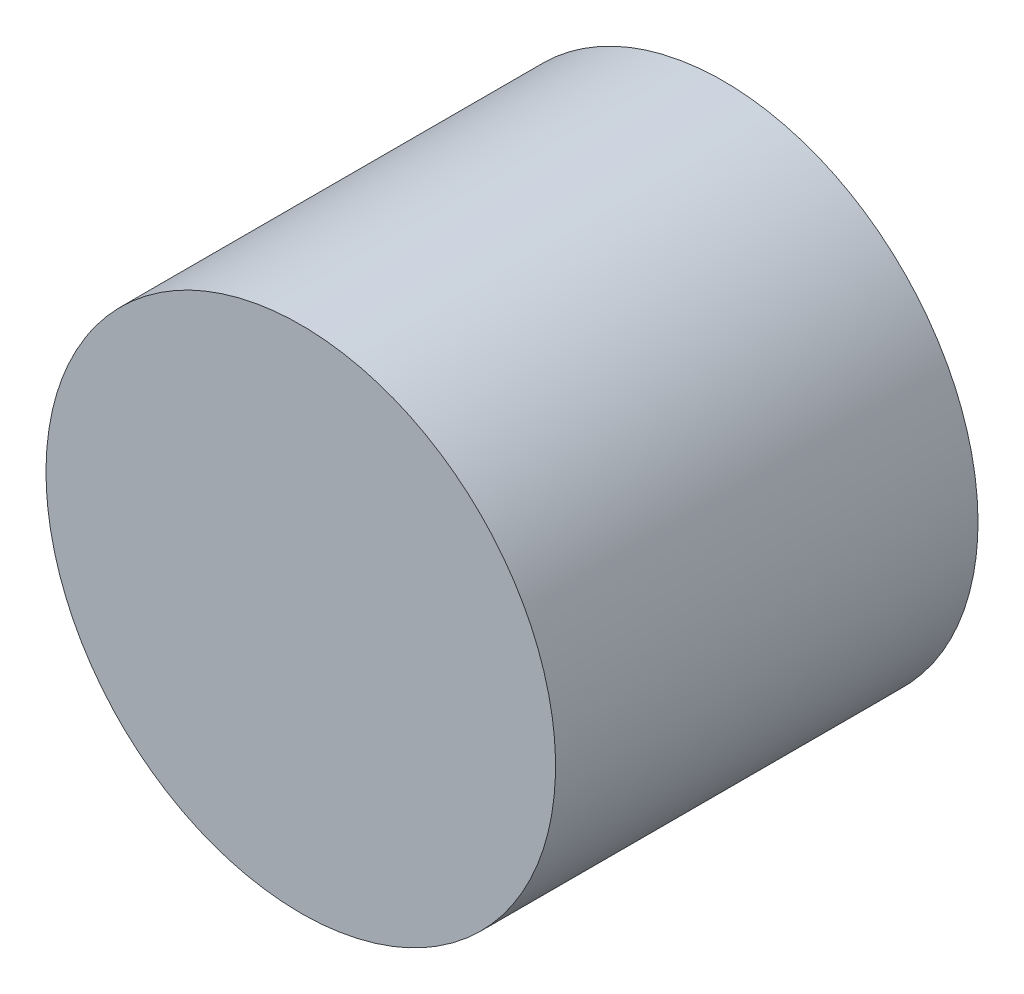
ISO-10303-21;
HEADER;
FILE_DESCRIPTION(('STEP AP214'),'2;1');
FILE_NAME('part.step','',(''),(''),'','','');
FILE_SCHEMA(('AUTOMOTIVE_DESIGN { 1 0 10303 214 1 1 1 1 }'));
ENDSEC;
DATA;
#1=APPLICATION_CONTEXT('core data for automotive mechanical design processes');
#2=APPLICATION_PROTOCOL_DEFINITION('international standard','automotive_design',2000,#1);
#3=PRODUCT_CONTEXT('',#1,'mechanical');
#4=PRODUCT('Part','Part','',(#3));
#5=PRODUCT_RELATED_PRODUCT_CATEGORY('part','',(#4));
#6=PRODUCT_DEFINITION_FORMATION('','',#4);
#7=PRODUCT_DEFINITION_CONTEXT('part definition',#1,'design');
#8=PRODUCT_DEFINITION('design','',#6,#7);
#9=PRODUCT_DEFINITION_SHAPE('','',#8);
#10=(LENGTH_UNIT() NAMED_UNIT(*) SI_UNIT(.MILLI.,.METRE.));
#11=(NAMED_UNIT(*) PLANE_ANGLE_UNIT() SI_UNIT($,.RADIAN.));
#12=(NAMED_UNIT(*) SI_UNIT($,.STERADIAN.) SOLID_ANGLE_UNIT());
#13=UNCERTAINTY_MEASURE_WITH_UNIT(LENGTH_MEASURE(1.E-05),#10,'distance_accuracy_value','');
#14=(GEOMETRIC_REPRESENTATION_CONTEXT(3) GLOBAL_UNCERTAINTY_ASSIGNED_CONTEXT((#13)) GLOBAL_UNIT_ASSIGNED_CONTEXT((#10,
#11,#12)) REPRESENTATION_CONTEXT('',''));
#15=CARTESIAN_POINT('',(0.,0.,0.));
#16=DIRECTION('',(0.,0.,1.));
#17=DIRECTION('',(1.,0.,0.));
#18=AXIS2_PLACEMENT_3D('',#15,#16,#17);
#19=CARTESIAN_POINT('',(-8.60005925706711,59.3566266738353,123.808385168912));
#20=CARTESIAN_POINT('',(-8.53276726538406,59.3566266738353,123.808385168912));
#21=CARTESIAN_POINT('',(-8.39818328201795,59.3833970925781,123.808385168912));
#22=CARTESIAN_POINT('',(-8.22704109415974,59.4977506465517,123.808385168912));
#23=CARTESIAN_POINT('',(-8.11268754018612,59.6688928344099,123.808385168912));
#24=CARTESIAN_POINT('',(-8.07253191207202,59.8707688094591,123.808385168912));
#25=CARTESIAN_POINT('',(-8.11268754018612,60.0726447845082,123.808385168912));
#26=CARTESIAN_POINT('',(-8.22704109415974,60.2437869723664,123.808385168912));
#27=CARTESIAN_POINT('',(-8.39818328201795,60.3581405263401,123.808385168912));
#28=CARTESIAN_POINT('',(-8.60005925706711,60.3982961544542,123.808385168912));
#29=CARTESIAN_POINT('',(-8.80193523211629,60.3581405263401,123.808385168912));
#30=CARTESIAN_POINT('',(-8.97307741997449,60.2437869723664,123.808385168912));
#31=CARTESIAN_POINT('',(-9.08743097394811,60.0726447845082,123.808385168912));
#32=CARTESIAN_POINT('',(-9.12758660206221,59.8707688094591,123.808385168912));
#33=CARTESIAN_POINT('',(-9.08743097394811,59.6688928344099,123.808385168912));
#34=CARTESIAN_POINT('',(-8.97307741997449,59.4977506465517,123.808385168912));
#35=CARTESIAN_POINT('',(-8.80193523211629,59.3833970925781,123.808385168912));
#36=CARTESIAN_POINT('',(-8.66735124875017,59.3566266738353,123.808385168912));
#37=CARTESIAN_POINT('',(-8.60005925706711,59.3566266738353,123.808385168912));
#38=B_SPLINE_CURVE_WITH_KNOTS('',3,(#19,#20,#21,#22,#23,#24,#25,#26,#27,#28,#29,#30,#31,#32,#33,
#34,#35,#36,#37),.UNSPECIFIED.,.T.,.F.,(4,1,1,1,1,1,1,1,1,1,1,1,1,1,1,1,4),(0.,
0.0625000000000002,0.125,0.187500000000001,0.25,0.312499999999999,0.375,0.4375,0.5,0.5625,0.625,
0.687500000000001,0.75,0.812499999999999,0.875,0.9375,1.),.UNSPECIFIED.);
#39=DIRECTION('',(0.,0.,1.));
#40=VECTOR('',#39,1.);
#41=SURFACE_OF_LINEAR_EXTRUSION('',#38,#40);
#42=CARTESIAN_POINT('',(-8.60005925706711,59.3566266738353,123.808385168912));
#43=CARTESIAN_POINT('',(-8.53276726538406,59.3566266738353,123.808385168912));
#44=CARTESIAN_POINT('',(-8.39818328201795,59.3833970925781,123.808385168912));
#45=CARTESIAN_POINT('',(-8.22704109415974,59.4977506465517,123.808385168912));
#46=CARTESIAN_POINT('',(-8.11268754018612,59.6688928344099,123.808385168912));
#47=CARTESIAN_POINT('',(-8.07253191207202,59.8707688094591,123.808385168912));
#48=CARTESIAN_POINT('',(-8.11268754018612,60.0726447845082,123.808385168912));
#49=CARTESIAN_POINT('',(-8.22704109415974,60.2437869723664,123.808385168912));
#50=CARTESIAN_POINT('',(-8.39818328201795,60.3581405263401,123.808385168912));
#51=CARTESIAN_POINT('',(-8.60005925706711,60.3982961544542,123.808385168912));
#52=CARTESIAN_POINT('',(-8.80193523211629,60.3581405263401,123.808385168912));
#53=CARTESIAN_POINT('',(-8.97307741997449,60.2437869723664,123.808385168912));
#54=CARTESIAN_POINT('',(-9.08743097394811,60.0726447845082,123.808385168912));
#55=CARTESIAN_POINT('',(-9.12758660206221,59.8707688094591,123.808385168912));
#56=CARTESIAN_POINT('',(-9.08743097394811,59.6688928344099,123.808385168912));
#57=CARTESIAN_POINT('',(-8.97307741997449,59.4977506465517,123.808385168912));
#58=CARTESIAN_POINT('',(-8.80193523211629,59.3833970925781,123.808385168912));
#59=CARTESIAN_POINT('',(-8.66735124875017,59.3566266738353,123.808385168912));
#60=CARTESIAN_POINT('',(-8.60005925706711,59.3566266738353,123.808385168912));
#61=B_SPLINE_CURVE_WITH_KNOTS('',3,(#42,#43,#44,#45,#46,#47,#48,#49,#50,#51,#52,#53,#54,#55,#56,
#57,#58,#59,#60),.UNSPECIFIED.,.T.,.F.,(4,1,1,1,1,1,1,1,1,1,1,1,1,1,1,1,4),(0.,
0.0625000000000002,0.125,0.187500000000001,0.25,0.312499999999999,0.375,0.4375,0.5,0.5625,0.625,
0.687500000000001,0.75,0.812499999999999,0.875,0.9375,1.),.UNSPECIFIED.);
#62=CARTESIAN_POINT('',(-8.60005925706711,59.3566266738353,123.808385168912));
#63=VERTEX_POINT('',#62);
#64=EDGE_CURVE('E9',#63,#63,#61,.T.);
#65=ORIENTED_EDGE('',*,*,#64,.T.);
#66=EDGE_LOOP('',(#65));
#67=FACE_BOUND('',#66,.T.);
#68=CARTESIAN_POINT('',(-8.60005925706711,59.3566266738353,124.660837467507));
#69=CARTESIAN_POINT('',(-8.60847095450285,59.3566266677456,124.660837467507));
#70=CARTESIAN_POINT('',(-8.61688247734347,59.356835826873,124.660837467507));
#71=CARTESIAN_POINT('',(-8.6336855158477,59.3576684286349,124.660837467507));
#72=CARTESIAN_POINT('',(-8.64207703030512,59.3582918956421,124.660837467507));
#73=CARTESIAN_POINT('',(-8.65881997405896,59.3599491221462,124.660837467507));
#74=CARTESIAN_POINT('',(-8.66717140056483,59.3609829097985,124.660837467507));
#75=CARTESIAN_POINT('',(-8.68381421142627,59.3634568007464,124.660837467507));
#76=CARTESIAN_POINT('',(-8.6921055931765,59.3648969215657,124.660837467507));
#77=CARTESIAN_POINT('',(-8.70860832154061,59.3681795180633,124.660837467507));
#78=CARTESIAN_POINT('',(-8.71681966815451,59.3700219937415,124.660837467507));
#79=CARTESIAN_POINT('',(-8.73314234076794,59.3741053462317,124.660837467507));
#80=CARTESIAN_POINT('',(-8.74125367106624,59.3763462058566,124.660837467507));
#81=CARTESIAN_POINT('',(-8.7573563142756,59.3812223690397,124.660837467507));
#82=CARTESIAN_POINT('',(-8.76534763538467,59.3838576455186,124.660837467507));
#83=CARTESIAN_POINT('',(-8.78119029028488,59.3895186899313,124.660837467507));
#84=CARTESIAN_POINT('',(-8.78904163228372,59.3925444348837,124.660837467507));
#85=CARTESIAN_POINT('',(-8.80458423621852,59.3989823922256,124.660837467507));
#86=CARTESIAN_POINT('',(-8.81227549815448,59.402394604615,124.660837467507));
#87=CARTESIAN_POINT('',(-8.82748090977111,59.4095940904492,124.660837467507));
#88=CARTESIAN_POINT('',(-8.83499504900514,59.413381385948,124.660837467507));
#89=CARTESIAN_POINT('',(-8.84982930521726,59.4213197060474,124.660837467507));
#90=CARTESIAN_POINT('',(-8.85714940884424,59.4254707555929,124.660837467507));
#91=CARTESIAN_POINT('',(-8.87157864775703,59.434125262058,124.660837467507));
#92=CARTESIAN_POINT('',(-8.87868777392944,59.4386287341704,124.660837467507));
#93=CARTESIAN_POINT('',(-8.89267811061651,59.447976778282,124.660837467507));
#94=CARTESIAN_POINT('',(-8.89955932113117,59.4528213502812,124.660837467507));
#95=CARTESIAN_POINT('',(-8.91307687319184,59.462840292543,124.660837467507));
#96=CARTESIAN_POINT('',(-8.91971322528662,59.468014648572,124.660837467507));
#97=CARTESIAN_POINT('',(-8.93272410083273,59.4786818506832,124.660837467507));
#98=CARTESIAN_POINT('',(-8.93909864222083,59.4841746748846,124.660837467507));
#99=CARTESIAN_POINT('',(-8.95156895893607,59.4954675195116,124.660837467507));
#100=CARTESIAN_POINT('',(-8.95766475064078,59.5012675218462,124.660837467507));
#101=CARTESIAN_POINT('',(-8.96956054468,59.5131633158854,124.660837467507));
#102=CARTESIAN_POINT('',(-8.97536054701452,59.5192591075901,124.660837467507));
#103=CARTESIAN_POINT('',(-8.9866533916416,59.5317294243053,124.660837467507));
#104=CARTESIAN_POINT('',(-8.992146215843,59.5381039656934,124.660837467507));
#105=CARTESIAN_POINT('',(-9.00281341795418,59.5511148412396,124.660837467507));
#106=CARTESIAN_POINT('',(-9.00798777398315,59.5577511933343,124.660837467507));
#107=CARTESIAN_POINT('',(-9.01800671624501,59.571268745395,124.660837467507));
#108=CARTESIAN_POINT('',(-9.02285128824417,59.5781499559097,124.660837467507));
#109=CARTESIAN_POINT('',(-9.03219933235575,59.5921402925967,124.660837467507));
#110=CARTESIAN_POINT('',(-9.03670280446818,59.5992494187691,124.660837467507));
#111=CARTESIAN_POINT('',(-9.04535731093325,59.613678657682,124.660837467507));
#112=CARTESIAN_POINT('',(-9.04950836047872,59.6209987613091,124.660837467507));
#113=CARTESIAN_POINT('',(-9.05744668057817,59.6358330175208,124.660837467507));
#114=CARTESIAN_POINT('',(-9.06123397607702,59.6433471567544,124.660837467507));
#115=CARTESIAN_POINT('',(-9.0684334619111,59.6585525683724,124.660837467507));
#116=CARTESIAN_POINT('',(-9.07184567430044,59.6662438303103,124.660837467507));
#117=CARTESIAN_POINT('',(-9.07828363164261,59.6817864342398,124.660837467507));
#118=CARTESIAN_POINT('',(-9.08130937659544,59.6896377762313,124.660837467507));
#119=CARTESIAN_POINT('',(-9.08697042100697,59.7054804311515,124.660837467507));
#120=CARTESIAN_POINT('',(-9.08960569748417,59.7134717522879,124.660837467507));
#121=CARTESIAN_POINT('',(-9.0944818606718,59.7295743954226,124.660837467507));
#122=CARTESIAN_POINT('',(-9.09672272030288,59.737685725619,124.660837467507));
#123=CARTESIAN_POINT('',(-9.10080607277627,59.7540083985109,124.660837467507));
#124=CARTESIAN_POINT('',(-9.10264854843148,59.7622197455053,124.660837467507));
#125=CARTESIAN_POINT('',(-9.10593114499185,59.7787224728299,124.660837467507));
#126=CARTESIAN_POINT('',(-9.10737126589699,59.7870138531602,124.660837467507));
#127=CARTESIAN_POINT('',(-9.10984515661046,59.803656667901,124.660837467507));
#128=CARTESIAN_POINT('',(-9.11087894394266,59.8120080997059,124.660837467507));
#129=CARTESIAN_POINT('',(-9.11253617132138,59.8287510289829,124.660837467507));
#130=CARTESIAN_POINT('',(-9.11315963952319,59.837142523666,124.660837467507));
#131=CARTESIAN_POINT('',(-9.11399223802138,59.8539456161936,124.660837467507));
#132=CARTESIAN_POINT('',(-9.11420139269084,59.8623572128263,124.660837467507));
#133=CARTESIAN_POINT('',(-9.11420139269084,59.8791804060918,124.660837467507));
#134=CARTESIAN_POINT('',(-9.11399223802138,59.8875920027245,124.660837467507));
#135=CARTESIAN_POINT('',(-9.11315963952319,59.9043950952521,124.660837467507));
#136=CARTESIAN_POINT('',(-9.11253617132138,59.9127865899353,124.660837467507));
#137=CARTESIAN_POINT('',(-9.11087894394266,59.9295295192122,124.660837467507));
#138=CARTESIAN_POINT('',(-9.10984515661046,59.9378809510171,124.660837467507));
#139=CARTESIAN_POINT('',(-9.10737126589699,59.9545237657579,124.660837467507));
#140=CARTESIAN_POINT('',(-9.10593114499184,59.9628151460882,124.660837467507));
#141=CARTESIAN_POINT('',(-9.10264854843148,59.9793178734128,124.660837467507));
#142=CARTESIAN_POINT('',(-9.10080607277627,59.9875292204072,124.660837467507));
#143=CARTESIAN_POINT('',(-9.09672272030288,60.0038518932991,124.660837467507));
#144=CARTESIAN_POINT('',(-9.0944818606718,60.0119632234955,124.660837467507));
#145=CARTESIAN_POINT('',(-9.08960569748417,60.0280658666302,124.660837467507));
#146=CARTESIAN_POINT('',(-9.08697042100697,60.0360571877666,124.660837467507));
#147=CARTESIAN_POINT('',(-9.08130937659544,60.0518998426868,124.660837467507));
#148=CARTESIAN_POINT('',(-9.07828363164261,60.0597511846783,124.660837467507));
#149=CARTESIAN_POINT('',(-9.07184567430044,60.0752937886078,124.660837467507));
#150=CARTESIAN_POINT('',(-9.0684334619111,60.0829850505457,124.660837467507));
#151=CARTESIAN_POINT('',(-9.06123397607702,60.0981904621638,124.660837467507));
#152=CARTESIAN_POINT('',(-9.05744668057817,60.1057046013973,124.660837467507));
#153=CARTESIAN_POINT('',(-9.04950836047872,60.120538857609,124.660837467507));
#154=CARTESIAN_POINT('',(-9.04535731093326,60.1278589612361,124.660837467507));
#155=CARTESIAN_POINT('',(-9.03670280446818,60.142288200149,124.660837467507));
#156=CARTESIAN_POINT('',(-9.03219933235575,60.1493973263214,124.660837467507));
#157=CARTESIAN_POINT('',(-9.02285128824417,60.1633876630084,124.660837467507));
#158=CARTESIAN_POINT('',(-9.01800671624502,60.1702688735231,124.660837467507));
#159=CARTESIAN_POINT('',(-9.00798777398316,60.1837864255838,124.660837467507));
#160=CARTESIAN_POINT('',(-9.00281341795418,60.1904227776786,124.660837467507));
#161=CARTESIAN_POINT('',(-8.992146215843,60.2034336532247,124.660837467507));
#162=CARTESIAN_POINT('',(-8.9866533916416,60.2098081946128,124.660837467507));
#163=CARTESIAN_POINT('',(-8.97536054701452,60.222278511328,124.660837467507));
#164=CARTESIAN_POINT('',(-8.96956054468,60.2283743030327,124.660837467507));
#165=CARTESIAN_POINT('',(-8.95766475064078,60.2402700970719,124.660837467507));
#166=CARTESIAN_POINT('',(-8.95156895893607,60.2460700994065,124.660837467507));
#167=CARTESIAN_POINT('',(-8.93909864222083,60.2573629440335,124.660837467507));
#168=CARTESIAN_POINT('',(-8.93272410083273,60.2628557682349,124.660837467507));
#169=CARTESIAN_POINT('',(-8.91971322528662,60.2735229703461,124.660837467507));
#170=CARTESIAN_POINT('',(-8.91307687319184,60.2786973263751,124.660837467507));
#171=CARTESIAN_POINT('',(-8.89955932113117,60.288716268637,124.660837467507));
#172=CARTESIAN_POINT('',(-8.8926781106165,60.2935608406361,124.660837467507));
#173=CARTESIAN_POINT('',(-8.87868777392945,60.3029088847477,124.660837467507));
#174=CARTESIAN_POINT('',(-8.87157864775708,60.3074123568601,124.660837467507));
#175=CARTESIAN_POINT('',(-8.85714940884419,60.3160668633252,124.660837467507));
#176=CARTESIAN_POINT('',(-8.84982930521707,60.3202179128707,124.660837467507));
#177=CARTESIAN_POINT('',(-8.83499504900533,60.3281562329701,124.660837467507));
#178=CARTESIAN_POINT('',(-8.82748090977183,60.331943528469,124.660837467507));
#179=CARTESIAN_POINT('',(-8.81227549815376,60.339143014303,124.660837467507));
#180=CARTESIAN_POINT('',(-8.80458423621585,60.3425552266924,124.660837467507));
#181=CARTESIAN_POINT('',(-8.7890416322864,60.3489931840345,124.660837467507));
#182=CARTESIAN_POINT('',(-8.78119029029487,60.3520189289874,124.660837467507));
#183=CARTESIAN_POINT('',(-8.76534763537467,60.3576799733989,124.660837467507));
#184=CARTESIAN_POINT('',(-8.75735631423828,60.3603152498761,124.660837467507));
#185=CARTESIAN_POINT('',(-8.74125367110355,60.3651914130637,124.660837467507));
#186=CARTESIAN_POINT('',(-8.73314234090719,60.3674322726948,124.660837467507));
#187=CARTESIAN_POINT('',(-8.71681966801524,60.3715156251682,124.660837467507));
#188=CARTESIAN_POINT('',(-8.70860832102086,60.3733581008234,124.660837467507));
#189=CARTESIAN_POINT('',(-8.69210559369624,60.3766406973838,124.660837467507));
#190=CARTESIAN_POINT('',(-8.683814213366,60.3780808182889,124.660837467507));
#191=CARTESIAN_POINT('',(-8.66717139862518,60.3805547090024,124.660837467507));
#192=CARTESIAN_POINT('',(-8.65881996682026,60.3815884963346,124.660837467507));
#193=CARTESIAN_POINT('',(-8.64207703754333,60.3832457237133,124.660837467507));
#194=CARTESIAN_POINT('',(-8.63368554286017,60.3838691919151,124.660837467507));
#195=CARTESIAN_POINT('',(-8.61688245033258,60.3847017904133,124.660837467507));
#196=CARTESIAN_POINT('',(-8.60847085369985,60.3849109450828,124.660837467507));
#197=CARTESIAN_POINT('',(-8.59164766043438,60.3849109450828,124.660837467507));
#198=CARTESIAN_POINT('',(-8.58323606380165,60.3847017904133,124.660837467507));
#199=CARTESIAN_POINT('',(-8.56643297127406,60.3838691919151,124.660837467507));
#200=CARTESIAN_POINT('',(-8.5580414765909,60.3832457237133,124.660837467507));
#201=CARTESIAN_POINT('',(-8.54129854731398,60.3815884963346,124.660837467507));
#202=CARTESIAN_POINT('',(-8.53294711550905,60.3805547090024,124.660837467507));
#203=CARTESIAN_POINT('',(-8.51630430076823,60.3780808182889,124.660837467507));
#204=CARTESIAN_POINT('',(-8.50801292043799,60.3766406973838,124.660837467507));
#205=CARTESIAN_POINT('',(-8.49151019311337,60.3733581008234,124.660837467507));
#206=CARTESIAN_POINT('',(-8.48329884611899,60.3715156251682,124.660837467507));
#207=CARTESIAN_POINT('',(-8.46697617322704,60.3674322726948,124.660837467507));
#208=CARTESIAN_POINT('',(-8.45886484303068,60.3651914130637,124.660837467507));
#209=CARTESIAN_POINT('',(-8.44276219989595,60.3603152498761,124.660837467507));
#210=CARTESIAN_POINT('',(-8.43477087875956,60.3576799733989,124.660837467507));
#211=CARTESIAN_POINT('',(-8.41892822383936,60.3520189289874,124.660837467507));
#212=CARTESIAN_POINT('',(-8.41107688184783,60.3489931840345,124.660837467507));
#213=CARTESIAN_POINT('',(-8.39553427791838,60.3425552266924,124.660837467507));
#214=CARTESIAN_POINT('',(-8.38784301598047,60.339143014303,124.660837467507));
#215=CARTESIAN_POINT('',(-8.37263760436241,60.331943528469,124.660837467507));
#216=CARTESIAN_POINT('',(-8.3651234651289,60.3281562329701,124.660837467507));
#217=CARTESIAN_POINT('',(-8.35028920891716,60.3202179128707,124.660837467507));
#218=CARTESIAN_POINT('',(-8.34296910529005,60.3160668633252,124.660837467507));
#219=CARTESIAN_POINT('',(-8.32853986637715,60.3074123568601,124.660837467507));
#220=CARTESIAN_POINT('',(-8.32143074020478,60.3029088847477,124.660837467507));
#221=CARTESIAN_POINT('',(-8.30744040351773,60.2935608406361,124.660837467507));
#222=CARTESIAN_POINT('',(-8.30055919300307,60.288716268637,124.660837467507));
#223=CARTESIAN_POINT('',(-8.28704164094239,60.2786973263751,124.660837467507));
#224=CARTESIAN_POINT('',(-8.28040528884761,60.2735229703461,124.660837467507));
#225=CARTESIAN_POINT('',(-8.2673944133015,60.2628557682349,124.660837467507));
#226=CARTESIAN_POINT('',(-8.2610198719134,60.2573629440335,124.660837467507));
#227=CARTESIAN_POINT('',(-8.24854955519816,60.2460700994065,124.660837467507));
#228=CARTESIAN_POINT('',(-8.24245376349345,60.2402700970719,124.660837467507));
#229=CARTESIAN_POINT('',(-8.23055796945423,60.2283743030327,124.660837467507));
#230=CARTESIAN_POINT('',(-8.22475796711971,60.222278511328,124.660837467507));
#231=CARTESIAN_POINT('',(-8.21346512249263,60.2098081946128,124.660837467507));
#232=CARTESIAN_POINT('',(-8.20797229829123,60.2034336532247,124.660837467507));
#233=CARTESIAN_POINT('',(-8.19730509618005,60.1904227776786,124.660837467507));
#234=CARTESIAN_POINT('',(-8.19213074015107,60.1837864255838,124.660837467507));
#235=CARTESIAN_POINT('',(-8.18211179788922,60.1702688735231,124.660837467507));
#236=CARTESIAN_POINT('',(-8.17726722589006,60.1633876630085,124.660837467507));
#237=CARTESIAN_POINT('',(-8.16791918177847,60.1493973263214,124.660837467507));
#238=CARTESIAN_POINT('',(-8.16341570966605,60.142288200149,124.660837467507));
#239=CARTESIAN_POINT('',(-8.15476120320098,60.1278589612361,124.660837467507));
#240=CARTESIAN_POINT('',(-8.15061015365552,60.120538857609,124.660837467507));
#241=CARTESIAN_POINT('',(-8.14267183355606,60.1057046013973,124.660837467507));
#242=CARTESIAN_POINT('',(-8.13888453805721,60.0981904621638,124.660837467507));
#243=CARTESIAN_POINT('',(-8.13168505222312,60.0829850505457,124.660837467507));
#244=CARTESIAN_POINT('',(-8.12827283983379,60.0752937886078,124.660837467507));
#245=CARTESIAN_POINT('',(-8.12183488249162,60.0597511846783,124.660837467507));
#246=CARTESIAN_POINT('',(-8.11880913753878,60.0518998426868,124.660837467507));
#247=CARTESIAN_POINT('',(-8.11314809312726,60.0360571877666,124.660837467507));
#248=CARTESIAN_POINT('',(-8.11051281665006,60.0280658666302,124.660837467507));
#249=CARTESIAN_POINT('',(-8.10563665346243,60.0119632234955,124.660837467507));
#250=CARTESIAN_POINT('',(-8.10339579383135,60.0038518932991,124.660837467507));
#251=CARTESIAN_POINT('',(-8.09931244135796,59.9875292204072,124.660837467507));
#252=CARTESIAN_POINT('',(-8.09746996570274,59.9793178734128,124.660837467507));
#253=CARTESIAN_POINT('',(-8.09418736914238,59.9628151460882,124.660837467507));
#254=CARTESIAN_POINT('',(-8.09274724823724,59.9545237657579,124.660837467507));
#255=CARTESIAN_POINT('',(-8.09027335752377,59.9378809510171,124.660837467507));
#256=CARTESIAN_POINT('',(-8.08923957019157,59.9295295192122,124.660837467507));
#257=CARTESIAN_POINT('',(-8.08758234281285,59.9127865899353,124.660837467507));
#258=CARTESIAN_POINT('',(-8.08695887461104,59.9043950952521,124.660837467507));
#259=CARTESIAN_POINT('',(-8.08612627611285,59.8875920027245,124.660837467507));
#260=CARTESIAN_POINT('',(-8.08591712144339,59.8791804060918,124.660837467507));
#261=CARTESIAN_POINT('',(-8.08591712144339,59.8623572128263,124.660837467507));
#262=CARTESIAN_POINT('',(-8.08612627611285,59.8539456161936,124.660837467507));
#263=CARTESIAN_POINT('',(-8.08695887461104,59.837142523666,124.660837467507));
#264=CARTESIAN_POINT('',(-8.08758234281285,59.8287510289829,124.660837467507));
#265=CARTESIAN_POINT('',(-8.08923957019157,59.8120080997059,124.660837467507));
#266=CARTESIAN_POINT('',(-8.09027335752377,59.803656667901,124.660837467507));
#267=CARTESIAN_POINT('',(-8.09274724823724,59.7870138531602,124.660837467507));
#268=CARTESIAN_POINT('',(-8.09418736914238,59.7787224728299,124.660837467507));
#269=CARTESIAN_POINT('',(-8.09746996570274,59.7622197455053,124.660837467507));
#270=CARTESIAN_POINT('',(-8.09931244135796,59.7540083985109,124.660837467507));
#271=CARTESIAN_POINT('',(-8.10339579383135,59.737685725619,124.660837467507));
#272=CARTESIAN_POINT('',(-8.10563665346244,59.7295743954226,124.660837467507));
#273=CARTESIAN_POINT('',(-8.11051281665006,59.7134717522879,124.660837467507));
#274=CARTESIAN_POINT('',(-8.11314809312726,59.7054804311515,124.660837467507));
#275=CARTESIAN_POINT('',(-8.11880913753878,59.6896377762313,124.660837467507));
#276=CARTESIAN_POINT('',(-8.12183488249162,59.6817864342398,124.660837467507));
#277=CARTESIAN_POINT('',(-8.12827283983379,59.6662438303103,124.660837467507));
#278=CARTESIAN_POINT('',(-8.13168505222313,59.6585525683724,124.660837467507));
#279=CARTESIAN_POINT('',(-8.13888453805721,59.6433471567544,124.660837467507));
#280=CARTESIAN_POINT('',(-8.14267183355605,59.6358330175208,124.660837467507));
#281=CARTESIAN_POINT('',(-8.15061015365551,59.6209987613091,124.660837467507));
#282=CARTESIAN_POINT('',(-8.15476120320098,59.613678657682,124.660837467507));
#283=CARTESIAN_POINT('',(-8.16341570966605,59.5992494187691,124.660837467507));
#284=CARTESIAN_POINT('',(-8.16791918177847,59.5921402925967,124.660837467507));
#285=CARTESIAN_POINT('',(-8.17726722589006,59.5781499559097,124.660837467507));
#286=CARTESIAN_POINT('',(-8.18211179788922,59.571268745395,124.660837467507));
#287=CARTESIAN_POINT('',(-8.19213074015108,59.5577511933343,124.660837467507));
#288=CARTESIAN_POINT('',(-8.19730509618005,59.5511148412396,124.660837467507));
#289=CARTESIAN_POINT('',(-8.20797229829123,59.5381039656934,124.660837467507));
#290=CARTESIAN_POINT('',(-8.21346512249263,59.5317294243053,124.660837467507));
#291=CARTESIAN_POINT('',(-8.22475796711971,59.5192591075901,124.660837467507));
#292=CARTESIAN_POINT('',(-8.23055796945423,59.5131633158854,124.660837467507));
#293=CARTESIAN_POINT('',(-8.24245376349345,59.5012675218462,124.660837467507));
#294=CARTESIAN_POINT('',(-8.24854955519816,59.4954675195116,124.660837467507));
#295=CARTESIAN_POINT('',(-8.2610198719134,59.4841746748846,124.660837467507));
#296=CARTESIAN_POINT('',(-8.2673944133015,59.4786818506832,124.660837467507));
#297=CARTESIAN_POINT('',(-8.28040528884761,59.468014648572,124.660837467507));
#298=CARTESIAN_POINT('',(-8.28704164094239,59.462840292543,124.660837467507));
#299=CARTESIAN_POINT('',(-8.30055919300306,59.4528213502812,124.660837467507));
#300=CARTESIAN_POINT('',(-8.30744040351771,59.447976778282,124.660837467507));
#301=CARTESIAN_POINT('',(-8.32143074020479,59.4386287341704,124.660837467507));
#302=CARTESIAN_POINT('',(-8.3285398663772,59.434125262058,124.660837467507));
#303=CARTESIAN_POINT('',(-8.34296910529,59.4254707555929,124.660837467507));
#304=CARTESIAN_POINT('',(-8.35028920891697,59.4213197060474,124.660837467507));
#305=CARTESIAN_POINT('',(-8.36512346512909,59.413381385948,124.660837467507));
#306=CARTESIAN_POINT('',(-8.37263760436312,59.4095940904492,124.660837467507));
#307=CARTESIAN_POINT('',(-8.38784301597975,59.402394604615,124.660837467507));
#308=CARTESIAN_POINT('',(-8.39553427791571,59.3989823922256,124.660837467507));
#309=CARTESIAN_POINT('',(-8.41107688185051,59.3925444348837,124.660837467507));
#310=CARTESIAN_POINT('',(-8.41892822384935,59.3895186899313,124.660837467507));
#311=CARTESIAN_POINT('',(-8.43477087874956,59.3838576455186,124.660837467507));
#312=CARTESIAN_POINT('',(-8.44276219985863,59.3812223690397,124.660837467507));
#313=CARTESIAN_POINT('',(-8.45886484306799,59.3763462058566,124.660837467507));
#314=CARTESIAN_POINT('',(-8.46697617336629,59.3741053462317,124.660837467507));
#315=CARTESIAN_POINT('',(-8.48329884597972,59.3700219937415,124.660837467507));
#316=CARTESIAN_POINT('',(-8.49151019259362,59.3681795180633,124.660837467507));
#317=CARTESIAN_POINT('',(-8.50801292095773,59.3648969215657,124.660837467507));
#318=CARTESIAN_POINT('',(-8.51630430270796,59.3634568007464,124.660837467507));
#319=CARTESIAN_POINT('',(-8.5329471135694,59.3609829097985,124.660837467507));
#320=CARTESIAN_POINT('',(-8.54129854007527,59.3599491221462,124.660837467507));
#321=CARTESIAN_POINT('',(-8.55804148382911,59.3582918956421,124.660837467507));
#322=CARTESIAN_POINT('',(-8.56643299828653,59.3576684286349,124.660837467507));
#323=CARTESIAN_POINT('',(-8.58323603679076,59.356835826873,124.660837467507));
#324=CARTESIAN_POINT('',(-8.59164755963138,59.3566266677456,124.660837467507));
#325=CARTESIAN_POINT('',(-8.60005925706711,59.3566266738353,124.660837467507));
#326=B_SPLINE_CURVE_WITH_KNOTS('',3,(#68,#69,#70,#71,#72,#73,#74,#75,#76,#77,#78,#79,#80,#81,
#82,#83,#84,#85,#86,#87,#88,#89,#90,#91,#92,#93,#94,#95,#96,#97,#98,#99,#100,#101,#102,#103,
#104,#105,#106,#107,#108,#109,#110,#111,#112,#113,#114,#115,#116,#117,#118,#119,#120,#121,#122,
#123,#124,#125,#126,#127,#128,#129,#130,#131,#132,#133,#134,#135,#136,#137,#138,#139,#140,#141,
#142,#143,#144,#145,#146,#147,#148,#149,#150,#151,#152,#153,#154,#155,#156,#157,#158,#159,#160,
#161,#162,#163,#164,#165,#166,#167,#168,#169,#170,#171,#172,#173,#174,#175,#176,#177,#178,#179,
#180,#181,#182,#183,#184,#185,#186,#187,#188,#189,#190,#191,#192,#193,#194,#195,#196,#197,#198,
#199,#200,#201,#202,#203,#204,#205,#206,#207,#208,#209,#210,#211,#212,#213,#214,#215,#216,#217,
#218,#219,#220,#221,#222,#223,#224,#225,#226,#227,#228,#229,#230,#231,#232,#233,#234,#235,#236,
#237,#238,#239,#240,#241,#242,#243,#244,#245,#246,#247,#248,#249,#250,#251,#252,#253,#254,#255,
#256,#257,#258,#259,#260,#261,#262,#263,#264,#265,#266,#267,#268,#269,#270,#271,#272,#273,#274,
#275,#276,#277,#278,#279,#280,#281,#282,#283,#284,#285,#286,#287,#288,#289,#290,#291,#292,#293,
#294,#295,#296,#297,#298,#299,#300,#301,#302,#303,#304,#305,#306,#307,#308,#309,#310,#311,#312,
#313,#314,#315,#316,#317,#318,#319,#320,#321,#322,#323,#324,#325),.UNSPECIFIED.,.F.,.F.,(4,2,2,
2,2,2,2,2,2,2,2,2,2,2,2,2,2,2,2,2,2,2,2,2,2,2,2,2,2,2,2,2,2,2,2,2,2,2,2,2,2,2,2,2,2,2,2,2,2,2,2,
2,2,2,2,2,2,2,2,2,2,2,2,2,2,2,2,2,2,2,2,2,2,2,2,2,2,2,2,2,2,2,2,2,2,2,2,2,2,2,2,2,2,2,2,2,2,2,2,
2,2,2,2,2,2,2,2,2,2,2,2,2,2,2,2,2,2,2,2,2,2,2,2,2,2,2,2,2,4),(0.,0.0252322451196304,
0.0504659747238382,0.075701436116341,0.100937986000663,0.126174535884988,0.15140999727749,
0.176643726881696,0.201875972001329,0.227108217120955,0.252341946725166,0.277577408117664,
0.302813958001991,0.328050507886307,0.353285969278813,0.378519698883019,0.403751944002649,
0.428984189122274,0.454217918726484,0.479453380118994,0.504689930003305,0.529926479887637,
0.555161941280142,0.580395670884341,0.605627916003976,0.6308601611236,0.6560938907278,
0.681329352120307,0.706565902004632,0.731802451888956,0.757037913281472,0.782271642885663,
0.807503888005304,0.832736133124931,0.85796986272913,0.883205324121632,0.908441874005956,
0.933678423890288,0.958913885282788,0.984147614886988,1.00937986000662,1.03461210512624,
1.05984583473045,1.08508129612296,1.11031784600727,1.1355543958916,1.1607898572841,
1.18602358688831,1.21125583200794,1.23648807712757,1.26172180673178,1.28695726812428,
1.3121938180086,1.33743036789293,1.36266582928543,1.38789955888963,1.41313180400927,
1.4383640491289,1.4635977787331,1.48883324012561,1.51406979000993,1.53930633989425,
1.56454180128675,1.58977553089096,1.61500777601059,1.64024002113022,1.66547375073442,
1.69070921212693,1.71594576201125,1.74118231189557,1.76641777328808,1.79165150289229,
1.81688374801191,1.84211599313155,1.86734972273575,1.89258518412825,1.91782173401258,
1.9430582838969,1.9682937452894,1.99352747489361,2.01875972001324,2.04399196513287,
2.06922569473707,2.09446115612957,2.11969770601389,2.14493425589822,2.17016971729073,
2.19540344689493,2.22063569201456,2.24586793713419,2.27110166673839,2.29633712813089,
2.32157367801522,2.34681022789954,2.37204568929205,2.39727941889624,2.42251166401588,
2.44774390913551,2.47297763873972,2.49821310013221,2.52344965001654,2.54868619990088,
2.57392166129336,2.59915539089758,2.62438763601721,2.64961988113683,2.67485361074104,
2.70008907213354,2.72532562201788,2.75056217190219,2.7757976332947,2.8010313628989,
2.82626360801854,2.85149585313817,2.87672958274237,2.90196504413487,2.9272015940192,
2.95243814390352,2.97767360529603,3.00290733490023,3.02813958001986,3.05337182513949,
3.07860555474369,3.1038410161362,3.12907756602052,3.15431411590484,3.17954957729735,
3.20478330690155,3.23001555202118),.UNSPECIFIED.);
#327=CARTESIAN_POINT('',(-8.60005925706711,59.3566266738353,124.660837467507));
#328=VERTEX_POINT('',#327);
#329=EDGE_CURVE('E24',#328,#328,#326,.F.);
#330=ORIENTED_EDGE('',*,*,#329,.F.);
#331=EDGE_LOOP('',(#330));
#332=FACE_BOUND('',#331,.T.);
#333=ADVANCED_FACE('F14',(#67,#332),#41,.T.);
#334=CARTESIAN_POINT('',(16.761447844137,68.1112219927909,123.808385168912));
#335=DIRECTION('',(0.,0.,1.));
#336=DIRECTION('',(0.,-1.,0.));
#337=AXIS2_PLACEMENT_3D('',#334,#335,#336);
#338=PLANE('',#337);
#339=ORIENTED_EDGE('',*,*,#64,.F.);
#340=EDGE_LOOP('',(#339));
#341=FACE_BOUND('',#340,.T.);
#342=ADVANCED_FACE('F62',(#341),#338,.F.);
#343=CARTESIAN_POINT('',(16.761447844137,68.1112219927909,124.660837467507));
#344=DIRECTION('',(0.,0.,1.));
#345=DIRECTION('',(0.,-1.,0.));
#346=AXIS2_PLACEMENT_3D('',#343,#344,#345);
#347=PLANE('',#346);
#348=ORIENTED_EDGE('',*,*,#329,.T.);
#349=EDGE_LOOP('',(#348));
#350=FACE_BOUND('',#349,.T.);
#351=ADVANCED_FACE('F31',(#350),#347,.T.);
#352=CLOSED_SHELL('',(#333,#342,#351));
#353=MANIFOLD_SOLID_BREP('B1',#352);
#354=ADVANCED_BREP_SHAPE_REPRESENTATION('',(#18,#353),#14);
#355=SHAPE_DEFINITION_REPRESENTATION(#9,#354);
ENDSEC;
END-ISO-10303-21;
